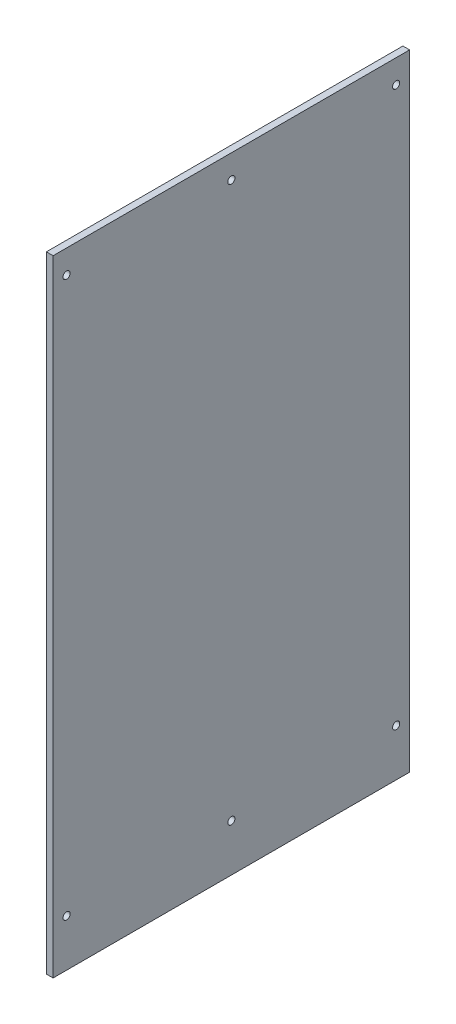
ISO-10303-21;
HEADER;
FILE_DESCRIPTION(('STEP AP214'),'2;1');
FILE_NAME('part.step','',(''),(''),'','','');
FILE_SCHEMA(('AUTOMOTIVE_DESIGN { 1 0 10303 214 1 1 1 1 }'));
ENDSEC;
DATA;
#1=APPLICATION_CONTEXT('core data for automotive mechanical design processes');
#2=APPLICATION_PROTOCOL_DEFINITION('international standard','automotive_design',2000,#1);
#3=PRODUCT_CONTEXT('',#1,'mechanical');
#4=PRODUCT('Part','Part','',(#3));
#5=PRODUCT_RELATED_PRODUCT_CATEGORY('part','',(#4));
#6=PRODUCT_DEFINITION_FORMATION('','',#4);
#7=PRODUCT_DEFINITION_CONTEXT('part definition',#1,'design');
#8=PRODUCT_DEFINITION('design','',#6,#7);
#9=PRODUCT_DEFINITION_SHAPE('','',#8);
#10=(LENGTH_UNIT() NAMED_UNIT(*) SI_UNIT(.MILLI.,.METRE.));
#11=(NAMED_UNIT(*) PLANE_ANGLE_UNIT() SI_UNIT($,.RADIAN.));
#12=(NAMED_UNIT(*) SI_UNIT($,.STERADIAN.) SOLID_ANGLE_UNIT());
#13=UNCERTAINTY_MEASURE_WITH_UNIT(LENGTH_MEASURE(1.E-05),#10,'distance_accuracy_value','');
#14=(GEOMETRIC_REPRESENTATION_CONTEXT(3) GLOBAL_UNCERTAINTY_ASSIGNED_CONTEXT((#13)) GLOBAL_UNIT_ASSIGNED_CONTEXT((#10,
#11,#12)) REPRESENTATION_CONTEXT('',''));
#15=CARTESIAN_POINT('',(0.,0.,0.));
#16=DIRECTION('',(0.,0.,1.));
#17=DIRECTION('',(1.,0.,0.));
#18=AXIS2_PLACEMENT_3D('',#15,#16,#17);
#19=CARTESIAN_POINT('',(0.,44.45,-12.7));
#20=DIRECTION('',(1.,0.,0.));
#21=DIRECTION('',(0.,0.,-1.));
#22=AXIS2_PLACEMENT_3D('',#19,#20,#21);
#23=CYLINDRICAL_SURFACE('',#22,3.37819999999999);
#24=CARTESIAN_POINT('',(0.,44.45,-12.7));
#25=DIRECTION('',(1.,0.,0.));
#26=DIRECTION('',(0.,0.,-1.));
#27=AXIS2_PLACEMENT_3D('',#24,#25,#26);
#28=CIRCLE('',#27,3.37819999999999);
#29=CARTESIAN_POINT('',(0.,44.45,-16.0782));
#30=VERTEX_POINT('',#29);
#31=EDGE_CURVE('E42',#30,#30,#28,.T.);
#32=ORIENTED_EDGE('',*,*,#31,.F.);
#33=EDGE_LOOP('',(#32));
#34=FACE_BOUND('',#33,.T.);
#35=CARTESIAN_POINT('',(6.35,44.45,-12.7));
#36=DIRECTION('',(1.,0.,0.));
#37=DIRECTION('',(0.,0.,-1.));
#38=AXIS2_PLACEMENT_3D('',#35,#36,#37);
#39=CIRCLE('',#38,3.37819999999999);
#40=CARTESIAN_POINT('',(6.35,44.45,-16.0782));
#41=VERTEX_POINT('',#40);
#42=EDGE_CURVE('E11',#41,#41,#39,.T.);
#43=ORIENTED_EDGE('',*,*,#42,.T.);
#44=EDGE_LOOP('',(#43));
#45=FACE_BOUND('',#44,.T.);
#46=ADVANCED_FACE('F34',(#34,#45),#23,.F.);
#47=CARTESIAN_POINT('',(0.,568.325,-12.7));
#48=DIRECTION('',(1.,0.,0.));
#49=DIRECTION('',(0.,0.,-1.));
#50=AXIS2_PLACEMENT_3D('',#47,#48,#49);
#51=CYLINDRICAL_SURFACE('',#50,3.37819999999999);
#52=CARTESIAN_POINT('',(0.,568.325,-12.7));
#53=DIRECTION('',(1.,0.,0.));
#54=DIRECTION('',(0.,0.,-1.));
#55=AXIS2_PLACEMENT_3D('',#52,#53,#54);
#56=CIRCLE('',#55,3.37819999999999);
#57=CARTESIAN_POINT('',(0.,568.325,-16.0782));
#58=VERTEX_POINT('',#57);
#59=EDGE_CURVE('E112',#58,#58,#56,.T.);
#60=ORIENTED_EDGE('',*,*,#59,.F.);
#61=EDGE_LOOP('',(#60));
#62=FACE_BOUND('',#61,.T.);
#63=CARTESIAN_POINT('',(6.35,568.325,-12.7));
#64=DIRECTION('',(1.,0.,0.));
#65=DIRECTION('',(0.,0.,-1.));
#66=AXIS2_PLACEMENT_3D('',#63,#64,#65);
#67=CIRCLE('',#66,3.37819999999999);
#68=CARTESIAN_POINT('',(6.35,568.325,-16.0782));
#69=VERTEX_POINT('',#68);
#70=EDGE_CURVE('E115',#69,#69,#67,.T.);
#71=ORIENTED_EDGE('',*,*,#70,.T.);
#72=EDGE_LOOP('',(#71));
#73=FACE_BOUND('',#72,.T.);
#74=ADVANCED_FACE('F124',(#62,#73),#51,.F.);
#75=CARTESIAN_POINT('',(6.35,0.,0.));
#76=DIRECTION('',(0.,0.,-1.));
#77=DIRECTION('',(0.,1.,0.));
#78=AXIS2_PLACEMENT_3D('',#75,#76,#77);
#79=PLANE('',#78);
#80=DIRECTION('',(0.,-1.,0.));
#81=VECTOR('',#80,1.);
#82=CARTESIAN_POINT('',(0.,0.,0.));
#83=LINE('',#82,#81);
#84=CARTESIAN_POINT('',(0.,590.55,1.11022302462516E-13));
#85=VERTEX_POINT('',#84);
#86=CARTESIAN_POINT('',(0.,0.,0.));
#87=VERTEX_POINT('',#86);
#88=EDGE_CURVE('E102',#85,#87,#83,.T.);
#89=ORIENTED_EDGE('',*,*,#88,.T.);
#90=DIRECTION('',(-1.,0.,0.));
#91=VECTOR('',#90,1.);
#92=CARTESIAN_POINT('',(6.35,0.,0.));
#93=LINE('',#92,#91);
#94=CARTESIAN_POINT('',(6.35,0.,0.));
#95=VERTEX_POINT('',#94);
#96=EDGE_CURVE('E93',#95,#87,#93,.T.);
#97=ORIENTED_EDGE('',*,*,#96,.F.);
#98=DIRECTION('',(0.,-1.,0.));
#99=VECTOR('',#98,1.);
#100=CARTESIAN_POINT('',(6.35,0.,0.));
#101=LINE('',#100,#99);
#102=CARTESIAN_POINT('',(6.35,590.55,1.11022302462516E-13));
#103=VERTEX_POINT('',#102);
#104=EDGE_CURVE('E87',#103,#95,#101,.T.);
#105=ORIENTED_EDGE('',*,*,#104,.F.);
#106=DIRECTION('',(-1.,0.,0.));
#107=VECTOR('',#106,1.);
#108=CARTESIAN_POINT('',(6.35,590.55,1.11022302462516E-13));
#109=LINE('',#108,#107);
#110=EDGE_CURVE('E98',#103,#85,#109,.T.);
#111=ORIENTED_EDGE('',*,*,#110,.T.);
#112=EDGE_LOOP('',(#89,#97,#105,#111));
#113=FACE_BOUND('',#112,.T.);
#114=ADVANCED_FACE('F148',(#113),#79,.F.);
#115=CARTESIAN_POINT('',(6.35,0.,0.));
#116=DIRECTION('',(0.,1.,0.));
#117=DIRECTION('',(0.,0.,1.));
#118=AXIS2_PLACEMENT_3D('',#115,#116,#117);
#119=PLANE('',#118);
#120=DIRECTION('',(0.,0.,-1.));
#121=VECTOR('',#120,1.);
#122=CARTESIAN_POINT('',(0.,0.,0.));
#123=LINE('',#122,#121);
#124=CARTESIAN_POINT('',(0.,0.,-336.55));
#125=VERTEX_POINT('',#124);
#126=EDGE_CURVE('E92',#87,#125,#123,.T.);
#127=ORIENTED_EDGE('',*,*,#126,.T.);
#128=DIRECTION('',(-1.,0.,0.));
#129=VECTOR('',#128,1.);
#130=CARTESIAN_POINT('',(6.35,0.,-336.55));
#131=LINE('',#130,#129);
#132=CARTESIAN_POINT('',(6.35,0.,-336.55));
#133=VERTEX_POINT('',#132);
#134=EDGE_CURVE('E90',#133,#125,#131,.T.);
#135=ORIENTED_EDGE('',*,*,#134,.F.);
#136=DIRECTION('',(0.,0.,-1.));
#137=VECTOR('',#136,1.);
#138=CARTESIAN_POINT('',(6.35,0.,0.));
#139=LINE('',#138,#137);
#140=EDGE_CURVE('E81',#95,#133,#139,.T.);
#141=ORIENTED_EDGE('',*,*,#140,.F.);
#142=ORIENTED_EDGE('',*,*,#96,.T.);
#143=EDGE_LOOP('',(#127,#135,#141,#142));
#144=FACE_BOUND('',#143,.T.);
#145=ADVANCED_FACE('F91',(#144),#119,.F.);
#146=CARTESIAN_POINT('',(6.35,0.,-336.55));
#147=DIRECTION('',(0.,0.,1.));
#148=DIRECTION('',(0.,-1.,0.));
#149=AXIS2_PLACEMENT_3D('',#146,#147,#148);
#150=PLANE('',#149);
#151=DIRECTION('',(0.,1.,0.));
#152=VECTOR('',#151,1.);
#153=CARTESIAN_POINT('',(0.,0.,-336.55));
#154=LINE('',#153,#152);
#155=CARTESIAN_POINT('',(0.,590.55,-336.55));
#156=VERTEX_POINT('',#155);
#157=EDGE_CURVE('E67',#125,#156,#154,.T.);
#158=ORIENTED_EDGE('',*,*,#157,.T.);
#159=DIRECTION('',(-1.,0.,0.));
#160=VECTOR('',#159,1.);
#161=CARTESIAN_POINT('',(6.35,590.55,-336.55));
#162=LINE('',#161,#160);
#163=CARTESIAN_POINT('',(6.35,590.55,-336.55));
#164=VERTEX_POINT('',#163);
#165=EDGE_CURVE('E94',#164,#156,#162,.T.);
#166=ORIENTED_EDGE('',*,*,#165,.F.);
#167=DIRECTION('',(0.,1.,0.));
#168=VECTOR('',#167,1.);
#169=CARTESIAN_POINT('',(6.35,0.,-336.55));
#170=LINE('',#169,#168);
#171=EDGE_CURVE('E85',#133,#164,#170,.T.);
#172=ORIENTED_EDGE('',*,*,#171,.F.);
#173=ORIENTED_EDGE('',*,*,#134,.T.);
#174=EDGE_LOOP('',(#158,#166,#172,#173));
#175=FACE_BOUND('',#174,.T.);
#176=ADVANCED_FACE('F96',(#175),#150,.F.);
#177=CARTESIAN_POINT('',(6.35,590.55,1.11022302462516E-13));
#178=DIRECTION('',(0.,-1.,0.));
#179=DIRECTION('',(0.,0.,-1.));
#180=AXIS2_PLACEMENT_3D('',#177,#178,#179);
#181=PLANE('',#180);
#182=DIRECTION('',(0.,0.,1.));
#183=VECTOR('',#182,1.);
#184=CARTESIAN_POINT('',(0.,590.55,1.11022302462516E-13));
#185=LINE('',#184,#183);
#186=EDGE_CURVE('E73',#156,#85,#185,.T.);
#187=ORIENTED_EDGE('',*,*,#186,.T.);
#188=ORIENTED_EDGE('',*,*,#110,.F.);
#189=DIRECTION('',(0.,0.,1.));
#190=VECTOR('',#189,1.);
#191=CARTESIAN_POINT('',(6.35,590.55,1.11022302462516E-13));
#192=LINE('',#191,#190);
#193=EDGE_CURVE('E50',#164,#103,#192,.T.);
#194=ORIENTED_EDGE('',*,*,#193,.F.);
#195=ORIENTED_EDGE('',*,*,#165,.T.);
#196=EDGE_LOOP('',(#187,#188,#194,#195));
#197=FACE_BOUND('',#196,.T.);
#198=ADVANCED_FACE('F128',(#197),#181,.F.);
#199=CARTESIAN_POINT('',(6.35,0.,0.));
#200=DIRECTION('',(-1.,0.,0.));
#201=DIRECTION('',(0.,0.,1.));
#202=AXIS2_PLACEMENT_3D('',#199,#200,#201);
#203=PLANE('',#202);
#204=CARTESIAN_POINT('',(6.35,44.45,-168.275));
#205=DIRECTION('',(1.,0.,0.));
#206=DIRECTION('',(0.,0.,-1.));
#207=AXIS2_PLACEMENT_3D('',#204,#205,#206);
#208=CIRCLE('',#207,3.37819999999999);
#209=CARTESIAN_POINT('',(6.35,44.45,-171.6532));
#210=VERTEX_POINT('',#209);
#211=EDGE_CURVE('E232',#210,#210,#208,.T.);
#212=ORIENTED_EDGE('',*,*,#211,.F.);
#213=EDGE_LOOP('',(#212));
#214=FACE_BOUND('',#213,.T.);
#215=CARTESIAN_POINT('',(6.35,568.325,-168.275));
#216=DIRECTION('',(1.,0.,0.));
#217=DIRECTION('',(0.,0.,-1.));
#218=AXIS2_PLACEMENT_3D('',#215,#216,#217);
#219=CIRCLE('',#218,3.37819999999999);
#220=CARTESIAN_POINT('',(6.35,568.325,-171.6532));
#221=VERTEX_POINT('',#220);
#222=EDGE_CURVE('E236',#221,#221,#219,.T.);
#223=ORIENTED_EDGE('',*,*,#222,.F.);
#224=EDGE_LOOP('',(#223));
#225=FACE_BOUND('',#224,.T.);
#226=CARTESIAN_POINT('',(6.35,568.325,-323.85));
#227=DIRECTION('',(1.,0.,0.));
#228=DIRECTION('',(0.,0.,-1.));
#229=AXIS2_PLACEMENT_3D('',#226,#227,#228);
#230=CIRCLE('',#229,3.37819999999999);
#231=CARTESIAN_POINT('',(6.35,568.325,-327.2282));
#232=VERTEX_POINT('',#231);
#233=EDGE_CURVE('E245',#232,#232,#230,.T.);
#234=ORIENTED_EDGE('',*,*,#233,.F.);
#235=EDGE_LOOP('',(#234));
#236=FACE_BOUND('',#235,.T.);
#237=CARTESIAN_POINT('',(6.35,44.45,-323.85));
#238=DIRECTION('',(1.,0.,0.));
#239=DIRECTION('',(0.,0.,-1.));
#240=AXIS2_PLACEMENT_3D('',#237,#238,#239);
#241=CIRCLE('',#240,3.37819999999999);
#242=CARTESIAN_POINT('',(6.35,44.45,-327.2282));
#243=VERTEX_POINT('',#242);
#244=EDGE_CURVE('E242',#243,#243,#241,.T.);
#245=ORIENTED_EDGE('',*,*,#244,.F.);
#246=EDGE_LOOP('',(#245));
#247=FACE_BOUND('',#246,.T.);
#248=ORIENTED_EDGE('',*,*,#104,.T.);
#249=ORIENTED_EDGE('',*,*,#140,.T.);
#250=ORIENTED_EDGE('',*,*,#171,.T.);
#251=ORIENTED_EDGE('',*,*,#193,.T.);
#252=EDGE_LOOP('',(#248,#249,#250,#251));
#253=FACE_BOUND('',#252,.T.);
#254=ORIENTED_EDGE('',*,*,#70,.F.);
#255=EDGE_LOOP('',(#254));
#256=FACE_BOUND('',#255,.T.);
#257=ORIENTED_EDGE('',*,*,#42,.F.);
#258=EDGE_LOOP('',(#257));
#259=FACE_BOUND('',#258,.T.);
#260=ADVANCED_FACE('F82',(#214,#225,#236,#247,#253,#256,#259),#203,.F.);
#261=CARTESIAN_POINT('',(0.,0.,0.));
#262=DIRECTION('',(-1.,0.,0.));
#263=DIRECTION('',(0.,0.,1.));
#264=AXIS2_PLACEMENT_3D('',#261,#262,#263);
#265=PLANE('',#264);
#266=CARTESIAN_POINT('',(0.,44.45,-168.275));
#267=DIRECTION('',(1.,0.,0.));
#268=DIRECTION('',(0.,0.,-1.));
#269=AXIS2_PLACEMENT_3D('',#266,#267,#268);
#270=CIRCLE('',#269,3.37819999999999);
#271=CARTESIAN_POINT('',(0.,44.45,-171.6532));
#272=VERTEX_POINT('',#271);
#273=EDGE_CURVE('E230',#272,#272,#270,.T.);
#274=ORIENTED_EDGE('',*,*,#273,.T.);
#275=EDGE_LOOP('',(#274));
#276=FACE_BOUND('',#275,.T.);
#277=CARTESIAN_POINT('',(0.,568.325,-168.275));
#278=DIRECTION('',(1.,0.,0.));
#279=DIRECTION('',(0.,0.,-1.));
#280=AXIS2_PLACEMENT_3D('',#277,#278,#279);
#281=CIRCLE('',#280,3.37819999999999);
#282=CARTESIAN_POINT('',(0.,568.325,-171.6532));
#283=VERTEX_POINT('',#282);
#284=EDGE_CURVE('E233',#283,#283,#281,.T.);
#285=ORIENTED_EDGE('',*,*,#284,.T.);
#286=EDGE_LOOP('',(#285));
#287=FACE_BOUND('',#286,.T.);
#288=CARTESIAN_POINT('',(0.,568.325,-323.85));
#289=DIRECTION('',(1.,0.,0.));
#290=DIRECTION('',(0.,0.,-1.));
#291=AXIS2_PLACEMENT_3D('',#288,#289,#290);
#292=CIRCLE('',#291,3.37819999999999);
#293=CARTESIAN_POINT('',(0.,568.325,-327.2282));
#294=VERTEX_POINT('',#293);
#295=EDGE_CURVE('E105',#294,#294,#292,.T.);
#296=ORIENTED_EDGE('',*,*,#295,.T.);
#297=EDGE_LOOP('',(#296));
#298=FACE_BOUND('',#297,.T.);
#299=CARTESIAN_POINT('',(0.,44.45,-323.85));
#300=DIRECTION('',(1.,0.,0.));
#301=DIRECTION('',(0.,0.,-1.));
#302=AXIS2_PLACEMENT_3D('',#299,#300,#301);
#303=CIRCLE('',#302,3.37819999999999);
#304=CARTESIAN_POINT('',(0.,44.45,-327.2282));
#305=VERTEX_POINT('',#304);
#306=EDGE_CURVE('E248',#305,#305,#303,.T.);
#307=ORIENTED_EDGE('',*,*,#306,.T.);
#308=EDGE_LOOP('',(#307));
#309=FACE_BOUND('',#308,.T.);
#310=ORIENTED_EDGE('',*,*,#88,.F.);
#311=ORIENTED_EDGE('',*,*,#186,.F.);
#312=ORIENTED_EDGE('',*,*,#157,.F.);
#313=ORIENTED_EDGE('',*,*,#126,.F.);
#314=EDGE_LOOP('',(#310,#311,#312,#313));
#315=FACE_BOUND('',#314,.T.);
#316=ORIENTED_EDGE('',*,*,#59,.T.);
#317=EDGE_LOOP('',(#316));
#318=FACE_BOUND('',#317,.T.);
#319=ORIENTED_EDGE('',*,*,#31,.T.);
#320=EDGE_LOOP('',(#319));
#321=FACE_BOUND('',#320,.T.);
#322=ADVANCED_FACE('F120',(#276,#287,#298,#309,#315,#318,#321),#265,.T.);
#323=CARTESIAN_POINT('',(0.,44.45,-323.85));
#324=DIRECTION('',(1.,0.,0.));
#325=DIRECTION('',(0.,0.,-1.));
#326=AXIS2_PLACEMENT_3D('',#323,#324,#325);
#327=CYLINDRICAL_SURFACE('',#326,3.37819999999999);
#328=ORIENTED_EDGE('',*,*,#306,.F.);
#329=EDGE_LOOP('',(#328));
#330=FACE_BOUND('',#329,.T.);
#331=ORIENTED_EDGE('',*,*,#244,.T.);
#332=EDGE_LOOP('',(#331));
#333=FACE_BOUND('',#332,.T.);
#334=ADVANCED_FACE('F135',(#330,#333),#327,.F.);
#335=CARTESIAN_POINT('',(0.,568.325,-323.85));
#336=DIRECTION('',(1.,0.,0.));
#337=DIRECTION('',(0.,0.,-1.));
#338=AXIS2_PLACEMENT_3D('',#335,#336,#337);
#339=CYLINDRICAL_SURFACE('',#338,3.37819999999999);
#340=ORIENTED_EDGE('',*,*,#295,.F.);
#341=EDGE_LOOP('',(#340));
#342=FACE_BOUND('',#341,.T.);
#343=ORIENTED_EDGE('',*,*,#233,.T.);
#344=EDGE_LOOP('',(#343));
#345=FACE_BOUND('',#344,.T.);
#346=ADVANCED_FACE('F187',(#342,#345),#339,.F.);
#347=CARTESIAN_POINT('',(0.,568.325,-168.275));
#348=DIRECTION('',(1.,0.,0.));
#349=DIRECTION('',(0.,0.,-1.));
#350=AXIS2_PLACEMENT_3D('',#347,#348,#349);
#351=CYLINDRICAL_SURFACE('',#350,3.37819999999999);
#352=ORIENTED_EDGE('',*,*,#284,.F.);
#353=EDGE_LOOP('',(#352));
#354=FACE_BOUND('',#353,.T.);
#355=ORIENTED_EDGE('',*,*,#222,.T.);
#356=EDGE_LOOP('',(#355));
#357=FACE_BOUND('',#356,.T.);
#358=ADVANCED_FACE('F196',(#354,#357),#351,.F.);
#359=CARTESIAN_POINT('',(0.,44.45,-168.275));
#360=DIRECTION('',(1.,0.,0.));
#361=DIRECTION('',(0.,0.,-1.));
#362=AXIS2_PLACEMENT_3D('',#359,#360,#361);
#363=CYLINDRICAL_SURFACE('',#362,3.37819999999999);
#364=ORIENTED_EDGE('',*,*,#273,.F.);
#365=EDGE_LOOP('',(#364));
#366=FACE_BOUND('',#365,.T.);
#367=ORIENTED_EDGE('',*,*,#211,.T.);
#368=EDGE_LOOP('',(#367));
#369=FACE_BOUND('',#368,.T.);
#370=ADVANCED_FACE('F213',(#366,#369),#363,.F.);
#371=CLOSED_SHELL('',(#46,#74,#114,#145,#176,#198,#260,#322,#334,#346,#358,#370));
#372=MANIFOLD_SOLID_BREP('B2',#371);
#373=ADVANCED_BREP_SHAPE_REPRESENTATION('',(#18,#372),#14);
#374=SHAPE_DEFINITION_REPRESENTATION(#9,#373);
ENDSEC;
END-ISO-10303-21;
